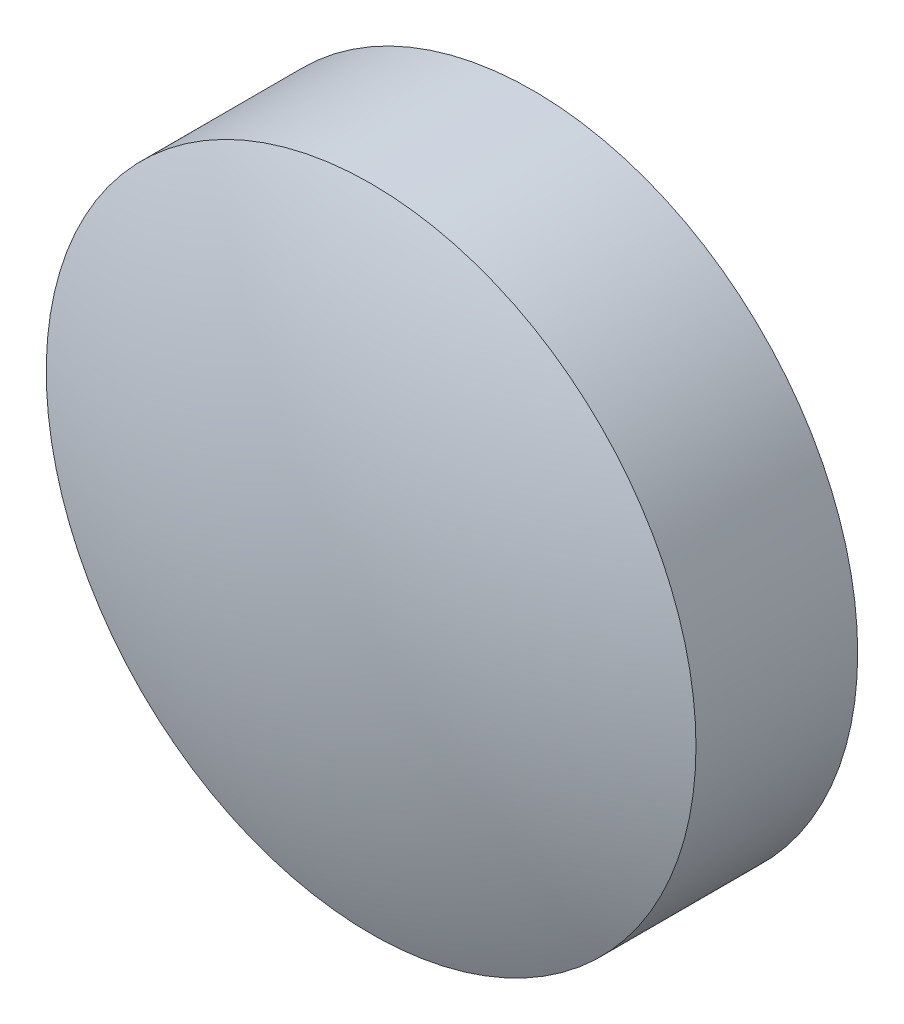
ISO-10303-21;
HEADER;
FILE_DESCRIPTION(('STEP AP214'),'2;1');
FILE_NAME('part.step','',(''),(''),'','','');
FILE_SCHEMA(('AUTOMOTIVE_DESIGN { 1 0 10303 214 1 1 1 1 }'));
ENDSEC;
DATA;
#1=APPLICATION_CONTEXT('core data for automotive mechanical design processes');
#2=APPLICATION_PROTOCOL_DEFINITION('international standard','automotive_design',2000,#1);
#3=PRODUCT_CONTEXT('',#1,'mechanical');
#4=PRODUCT('Part','Part','',(#3));
#5=PRODUCT_RELATED_PRODUCT_CATEGORY('part','',(#4));
#6=PRODUCT_DEFINITION_FORMATION('','',#4);
#7=PRODUCT_DEFINITION_CONTEXT('part definition',#1,'design');
#8=PRODUCT_DEFINITION('design','',#6,#7);
#9=PRODUCT_DEFINITION_SHAPE('','',#8);
#10=(LENGTH_UNIT() NAMED_UNIT(*) SI_UNIT(.MILLI.,.METRE.));
#11=(NAMED_UNIT(*) PLANE_ANGLE_UNIT() SI_UNIT($,.RADIAN.));
#12=(NAMED_UNIT(*) SI_UNIT($,.STERADIAN.) SOLID_ANGLE_UNIT());
#13=UNCERTAINTY_MEASURE_WITH_UNIT(LENGTH_MEASURE(1.E-05),#10,'distance_accuracy_value','');
#14=(GEOMETRIC_REPRESENTATION_CONTEXT(3) GLOBAL_UNCERTAINTY_ASSIGNED_CONTEXT((#13)) GLOBAL_UNIT_ASSIGNED_CONTEXT((#10,
#11,#12)) REPRESENTATION_CONTEXT('',''));
#15=CARTESIAN_POINT('',(0.,0.,0.));
#16=DIRECTION('',(0.,0.,1.));
#17=DIRECTION('',(1.,0.,0.));
#18=AXIS2_PLACEMENT_3D('',#15,#16,#17);
#19=CARTESIAN_POINT('',(0.,0.,-6.67));
#20=DIRECTION('',(0.,0.,1.));
#21=DIRECTION('',(0.,1.,0.));
#22=AXIS2_PLACEMENT_3D('',#19,#20,#21);
#23=SPHERICAL_SURFACE('',#22,7.72);
#24=CARTESIAN_POINT('',(0.,0.,0.443255232311015));
#25=DIRECTION('',(0.,0.,1.));
#26=DIRECTION('',(1.,0.,0.));
#27=AXIS2_PLACEMENT_3D('',#24,#25,#26);
#28=CIRCLE('',#27,3.);
#29=CARTESIAN_POINT('',(3.,0.,0.443255232311015));
#30=VERTEX_POINT('',#29);
#31=EDGE_CURVE('E8',#30,#30,#28,.T.);
#32=ORIENTED_EDGE('',*,*,#31,.T.);
#33=EDGE_LOOP('',(#32));
#34=FACE_BOUND('',#33,.T.);
#35=ADVANCED_FACE('F12',(#34),#23,.T.);
#36=CARTESIAN_POINT('',(0.,0.,4.30813204540037));
#37=DIRECTION('',(0.,0.,1.));
#38=DIRECTION('',(1.,0.,0.));
#39=AXIS2_PLACEMENT_3D('',#36,#37,#38);
#40=CYLINDRICAL_SURFACE('',#39,3.);
#41=ORIENTED_EDGE('',*,*,#31,.F.);
#42=EDGE_LOOP('',(#41));
#43=FACE_BOUND('',#42,.T.);
#44=CARTESIAN_POINT('',(0.,0.,-1.05));
#45=DIRECTION('',(0.,0.,1.));
#46=DIRECTION('',(1.,0.,0.));
#47=AXIS2_PLACEMENT_3D('',#44,#45,#46);
#48=CIRCLE('',#47,3.);
#49=CARTESIAN_POINT('',(3.,0.,-1.05));
#50=VERTEX_POINT('',#49);
#51=EDGE_CURVE('E18',#50,#50,#48,.T.);
#52=ORIENTED_EDGE('',*,*,#51,.T.);
#53=EDGE_LOOP('',(#52));
#54=FACE_BOUND('',#53,.T.);
#55=ADVANCED_FACE('F24',(#43,#54),#40,.T.);
#56=CARTESIAN_POINT('',(0.,0.,-1.05));
#57=DIRECTION('',(0.,0.,1.));
#58=DIRECTION('',(1.,0.,0.));
#59=AXIS2_PLACEMENT_3D('',#56,#57,#58);
#60=PLANE('',#59);
#61=ORIENTED_EDGE('',*,*,#51,.F.);
#62=EDGE_LOOP('',(#61));
#63=FACE_BOUND('',#62,.T.);
#64=ADVANCED_FACE('F26',(#63),#60,.F.);
#65=CLOSED_SHELL('',(#35,#55,#64));
#66=MANIFOLD_SOLID_BREP('B1',#65);
#67=ADVANCED_BREP_SHAPE_REPRESENTATION('',(#18,#66),#14);
#68=SHAPE_DEFINITION_REPRESENTATION(#9,#67);
ENDSEC;
END-ISO-10303-21;
